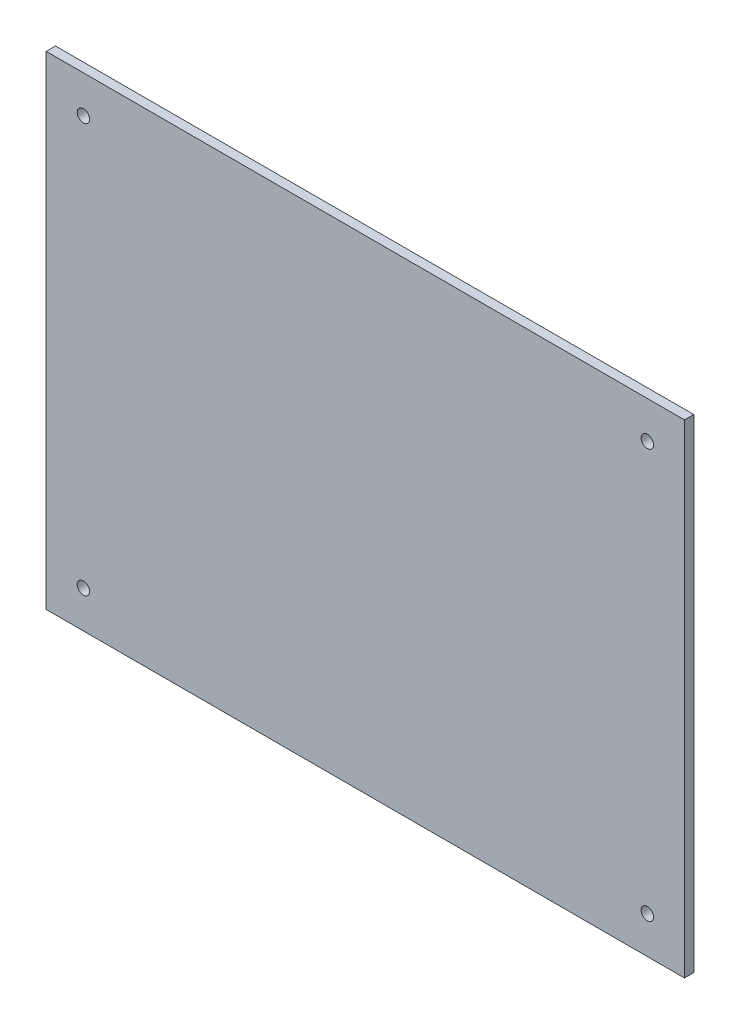
ISO-10303-21;
HEADER;
FILE_DESCRIPTION(('STEP AP214'),'2;1');
FILE_NAME('part.step','',(''),(''),'','','');
FILE_SCHEMA(('AUTOMOTIVE_DESIGN { 1 0 10303 214 1 1 1 1 }'));
ENDSEC;
DATA;
#1=APPLICATION_CONTEXT('core data for automotive mechanical design processes');
#2=APPLICATION_PROTOCOL_DEFINITION('international standard','automotive_design',2000,#1);
#3=PRODUCT_CONTEXT('',#1,'mechanical');
#4=PRODUCT('Part','Part','',(#3));
#5=PRODUCT_RELATED_PRODUCT_CATEGORY('part','',(#4));
#6=PRODUCT_DEFINITION_FORMATION('','',#4);
#7=PRODUCT_DEFINITION_CONTEXT('part definition',#1,'design');
#8=PRODUCT_DEFINITION('design','',#6,#7);
#9=PRODUCT_DEFINITION_SHAPE('','',#8);
#10=(LENGTH_UNIT() NAMED_UNIT(*) SI_UNIT(.MILLI.,.METRE.));
#11=(NAMED_UNIT(*) PLANE_ANGLE_UNIT() SI_UNIT($,.RADIAN.));
#12=(NAMED_UNIT(*) SI_UNIT($,.STERADIAN.) SOLID_ANGLE_UNIT());
#13=UNCERTAINTY_MEASURE_WITH_UNIT(LENGTH_MEASURE(1.E-05),#10,'distance_accuracy_value','');
#14=(GEOMETRIC_REPRESENTATION_CONTEXT(3) GLOBAL_UNCERTAINTY_ASSIGNED_CONTEXT((#13)) GLOBAL_UNIT_ASSIGNED_CONTEXT((#10,
#11,#12)) REPRESENTATION_CONTEXT('',''));
#15=CARTESIAN_POINT('',(0.,0.,0.));
#16=DIRECTION('',(0.,0.,1.));
#17=DIRECTION('',(1.,0.,0.));
#18=AXIS2_PLACEMENT_3D('',#15,#16,#17);
#19=CARTESIAN_POINT('',(0.,0.,3.));
#20=DIRECTION('',(1.,0.,0.));
#21=DIRECTION('',(0.,0.,-1.));
#22=AXIS2_PLACEMENT_3D('',#19,#20,#21);
#23=PLANE('',#22);
#24=DIRECTION('',(0.,-1.,0.));
#25=VECTOR('',#24,1.);
#26=CARTESIAN_POINT('',(0.,0.,0.));
#27=LINE('',#26,#25);
#28=CARTESIAN_POINT('',(0.,156.,0.));
#29=VERTEX_POINT('',#28);
#30=CARTESIAN_POINT('',(0.,0.,0.));
#31=VERTEX_POINT('',#30);
#32=EDGE_CURVE('E96',#29,#31,#27,.T.);
#33=ORIENTED_EDGE('',*,*,#32,.T.);
#34=DIRECTION('',(0.,0.,-1.));
#35=VECTOR('',#34,1.);
#36=CARTESIAN_POINT('',(0.,0.,3.));
#37=LINE('',#36,#35);
#38=CARTESIAN_POINT('',(0.,0.,3.));
#39=VERTEX_POINT('',#38);
#40=EDGE_CURVE('E11',#39,#31,#37,.T.);
#41=ORIENTED_EDGE('',*,*,#40,.F.);
#42=DIRECTION('',(0.,-1.,0.));
#43=VECTOR('',#42,1.);
#44=CARTESIAN_POINT('',(0.,0.,3.));
#45=LINE('',#44,#43);
#46=CARTESIAN_POINT('',(0.,156.,3.));
#47=VERTEX_POINT('',#46);
#48=EDGE_CURVE('E84',#47,#39,#45,.T.);
#49=ORIENTED_EDGE('',*,*,#48,.F.);
#50=DIRECTION('',(0.,0.,-1.));
#51=VECTOR('',#50,1.);
#52=CARTESIAN_POINT('',(0.,156.,3.));
#53=LINE('',#52,#51);
#54=EDGE_CURVE('E92',#47,#29,#53,.T.);
#55=ORIENTED_EDGE('',*,*,#54,.T.);
#56=EDGE_LOOP('',(#33,#41,#49,#55));
#57=FACE_BOUND('',#56,.T.);
#58=ADVANCED_FACE('F33',(#57),#23,.F.);
#59=CARTESIAN_POINT('',(0.,0.,3.));
#60=DIRECTION('',(0.,1.,0.));
#61=DIRECTION('',(0.,0.,1.));
#62=AXIS2_PLACEMENT_3D('',#59,#60,#61);
#63=PLANE('',#62);
#64=DIRECTION('',(1.,0.,0.));
#65=VECTOR('',#64,1.);
#66=CARTESIAN_POINT('',(0.,0.,0.));
#67=LINE('',#66,#65);
#68=CARTESIAN_POINT('',(206.,0.,0.));
#69=VERTEX_POINT('',#68);
#70=EDGE_CURVE('E88',#31,#69,#67,.T.);
#71=ORIENTED_EDGE('',*,*,#70,.T.);
#72=DIRECTION('',(0.,0.,-1.));
#73=VECTOR('',#72,1.);
#74=CARTESIAN_POINT('',(206.,0.,3.));
#75=LINE('',#74,#73);
#76=CARTESIAN_POINT('',(206.,0.,3.));
#77=VERTEX_POINT('',#76);
#78=EDGE_CURVE('E41',#77,#69,#75,.T.);
#79=ORIENTED_EDGE('',*,*,#78,.F.);
#80=DIRECTION('',(1.,0.,0.));
#81=VECTOR('',#80,1.);
#82=CARTESIAN_POINT('',(0.,0.,3.));
#83=LINE('',#82,#81);
#84=EDGE_CURVE('E79',#39,#77,#83,.T.);
#85=ORIENTED_EDGE('',*,*,#84,.F.);
#86=ORIENTED_EDGE('',*,*,#40,.T.);
#87=EDGE_LOOP('',(#71,#79,#85,#86));
#88=FACE_BOUND('',#87,.T.);
#89=ADVANCED_FACE('F87',(#88),#63,.F.);
#90=CARTESIAN_POINT('',(206.,0.,3.));
#91=DIRECTION('',(-1.,0.,0.));
#92=DIRECTION('',(0.,0.,1.));
#93=AXIS2_PLACEMENT_3D('',#90,#91,#92);
#94=PLANE('',#93);
#95=DIRECTION('',(0.,1.,0.));
#96=VECTOR('',#95,1.);
#97=CARTESIAN_POINT('',(206.,0.,0.));
#98=LINE('',#97,#96);
#99=CARTESIAN_POINT('',(206.,156.,0.));
#100=VERTEX_POINT('',#99);
#101=EDGE_CURVE('E66',#69,#100,#98,.T.);
#102=ORIENTED_EDGE('',*,*,#101,.T.);
#103=DIRECTION('',(0.,0.,-1.));
#104=VECTOR('',#103,1.);
#105=CARTESIAN_POINT('',(206.,156.,3.));
#106=LINE('',#105,#104);
#107=CARTESIAN_POINT('',(206.,156.,3.));
#108=VERTEX_POINT('',#107);
#109=EDGE_CURVE('E89',#108,#100,#106,.T.);
#110=ORIENTED_EDGE('',*,*,#109,.F.);
#111=DIRECTION('',(0.,1.,0.));
#112=VECTOR('',#111,1.);
#113=CARTESIAN_POINT('',(206.,0.,3.));
#114=LINE('',#113,#112);
#115=EDGE_CURVE('E82',#77,#108,#114,.T.);
#116=ORIENTED_EDGE('',*,*,#115,.F.);
#117=ORIENTED_EDGE('',*,*,#78,.T.);
#118=EDGE_LOOP('',(#102,#110,#116,#117));
#119=FACE_BOUND('',#118,.T.);
#120=ADVANCED_FACE('F90',(#119),#94,.F.);
#121=CARTESIAN_POINT('',(0.,156.,3.));
#122=DIRECTION('',(0.,-1.,0.));
#123=DIRECTION('',(0.,0.,-1.));
#124=AXIS2_PLACEMENT_3D('',#121,#122,#123);
#125=PLANE('',#124);
#126=DIRECTION('',(-1.,0.,0.));
#127=VECTOR('',#126,1.);
#128=CARTESIAN_POINT('',(0.,156.,0.));
#129=LINE('',#128,#127);
#130=EDGE_CURVE('E72',#100,#29,#129,.T.);
#131=ORIENTED_EDGE('',*,*,#130,.T.);
#132=ORIENTED_EDGE('',*,*,#54,.F.);
#133=DIRECTION('',(-1.,0.,0.));
#134=VECTOR('',#133,1.);
#135=CARTESIAN_POINT('',(0.,156.,3.));
#136=LINE('',#135,#134);
#137=EDGE_CURVE('E49',#108,#47,#136,.T.);
#138=ORIENTED_EDGE('',*,*,#137,.F.);
#139=ORIENTED_EDGE('',*,*,#109,.T.);
#140=EDGE_LOOP('',(#131,#132,#138,#139));
#141=FACE_BOUND('',#140,.T.);
#142=ADVANCED_FACE('F104',(#141),#125,.F.);
#143=CARTESIAN_POINT('',(0.,0.,3.));
#144=DIRECTION('',(0.,0.,-1.));
#145=DIRECTION('',(-1.,0.,0.));
#146=AXIS2_PLACEMENT_3D('',#143,#144,#145);
#147=PLANE('',#146);
#148=CARTESIAN_POINT('',(194.,144.,3.));
#149=DIRECTION('',(0.,0.,1.));
#150=DIRECTION('',(-1.,0.,0.));
#151=AXIS2_PLACEMENT_3D('',#148,#149,#150);
#152=CIRCLE('',#151,2.);
#153=CARTESIAN_POINT('',(192.,144.,3.));
#154=VERTEX_POINT('',#153);
#155=EDGE_CURVE('E128',#154,#154,#152,.T.);
#156=ORIENTED_EDGE('',*,*,#155,.F.);
#157=EDGE_LOOP('',(#156));
#158=FACE_BOUND('',#157,.T.);
#159=CARTESIAN_POINT('',(194.,12.,3.));
#160=DIRECTION('',(0.,0.,1.));
#161=DIRECTION('',(1.,0.,0.));
#162=AXIS2_PLACEMENT_3D('',#159,#160,#161);
#163=CIRCLE('',#162,2.);
#164=CARTESIAN_POINT('',(196.,12.,3.));
#165=VERTEX_POINT('',#164);
#166=EDGE_CURVE('E122',#165,#165,#163,.T.);
#167=ORIENTED_EDGE('',*,*,#166,.F.);
#168=EDGE_LOOP('',(#167));
#169=FACE_BOUND('',#168,.T.);
#170=CARTESIAN_POINT('',(12.,12.,3.));
#171=DIRECTION('',(0.,0.,1.));
#172=DIRECTION('',(-1.,0.,0.));
#173=AXIS2_PLACEMENT_3D('',#170,#171,#172);
#174=CIRCLE('',#173,2.);
#175=CARTESIAN_POINT('',(10.,12.,3.));
#176=VERTEX_POINT('',#175);
#177=EDGE_CURVE('E116',#176,#176,#174,.T.);
#178=ORIENTED_EDGE('',*,*,#177,.F.);
#179=EDGE_LOOP('',(#178));
#180=FACE_BOUND('',#179,.T.);
#181=CARTESIAN_POINT('',(12.,144.,3.));
#182=DIRECTION('',(0.,0.,1.));
#183=DIRECTION('',(1.,0.,0.));
#184=AXIS2_PLACEMENT_3D('',#181,#182,#183);
#185=CIRCLE('',#184,2.);
#186=CARTESIAN_POINT('',(14.,144.,3.));
#187=VERTEX_POINT('',#186);
#188=EDGE_CURVE('E110',#187,#187,#185,.T.);
#189=ORIENTED_EDGE('',*,*,#188,.F.);
#190=EDGE_LOOP('',(#189));
#191=FACE_BOUND('',#190,.T.);
#192=ORIENTED_EDGE('',*,*,#48,.T.);
#193=ORIENTED_EDGE('',*,*,#84,.T.);
#194=ORIENTED_EDGE('',*,*,#115,.T.);
#195=ORIENTED_EDGE('',*,*,#137,.T.);
#196=EDGE_LOOP('',(#192,#193,#194,#195));
#197=FACE_BOUND('',#196,.T.);
#198=ADVANCED_FACE('F80',(#158,#169,#180,#191,#197),#147,.F.);
#199=CARTESIAN_POINT('',(0.,0.,0.));
#200=DIRECTION('',(0.,0.,-1.));
#201=DIRECTION('',(-1.,0.,0.));
#202=AXIS2_PLACEMENT_3D('',#199,#200,#201);
#203=PLANE('',#202);
#204=CARTESIAN_POINT('',(194.,144.,0.));
#205=DIRECTION('',(0.,0.,1.));
#206=DIRECTION('',(-1.,0.,0.));
#207=AXIS2_PLACEMENT_3D('',#204,#205,#206);
#208=CIRCLE('',#207,2.);
#209=CARTESIAN_POINT('',(192.,144.,0.));
#210=VERTEX_POINT('',#209);
#211=EDGE_CURVE('E113',#210,#210,#208,.T.);
#212=ORIENTED_EDGE('',*,*,#211,.T.);
#213=EDGE_LOOP('',(#212));
#214=FACE_BOUND('',#213,.T.);
#215=CARTESIAN_POINT('',(194.,12.,0.));
#216=DIRECTION('',(0.,0.,1.));
#217=DIRECTION('',(1.,0.,0.));
#218=AXIS2_PLACEMENT_3D('',#215,#216,#217);
#219=CIRCLE('',#218,2.);
#220=CARTESIAN_POINT('',(196.,12.,0.));
#221=VERTEX_POINT('',#220);
#222=EDGE_CURVE('E125',#221,#221,#219,.T.);
#223=ORIENTED_EDGE('',*,*,#222,.T.);
#224=EDGE_LOOP('',(#223));
#225=FACE_BOUND('',#224,.T.);
#226=CARTESIAN_POINT('',(12.,12.,0.));
#227=DIRECTION('',(0.,0.,1.));
#228=DIRECTION('',(-1.,0.,0.));
#229=AXIS2_PLACEMENT_3D('',#226,#227,#228);
#230=CIRCLE('',#229,2.);
#231=CARTESIAN_POINT('',(10.,12.,0.));
#232=VERTEX_POINT('',#231);
#233=EDGE_CURVE('E119',#232,#232,#230,.T.);
#234=ORIENTED_EDGE('',*,*,#233,.T.);
#235=EDGE_LOOP('',(#234));
#236=FACE_BOUND('',#235,.T.);
#237=CARTESIAN_POINT('',(12.,144.,0.));
#238=DIRECTION('',(0.,0.,1.));
#239=DIRECTION('',(1.,0.,0.));
#240=AXIS2_PLACEMENT_3D('',#237,#238,#239);
#241=CIRCLE('',#240,2.);
#242=CARTESIAN_POINT('',(14.,144.,0.));
#243=VERTEX_POINT('',#242);
#244=EDGE_CURVE('E99',#243,#243,#241,.T.);
#245=ORIENTED_EDGE('',*,*,#244,.T.);
#246=EDGE_LOOP('',(#245));
#247=FACE_BOUND('',#246,.T.);
#248=ORIENTED_EDGE('',*,*,#32,.F.);
#249=ORIENTED_EDGE('',*,*,#130,.F.);
#250=ORIENTED_EDGE('',*,*,#101,.F.);
#251=ORIENTED_EDGE('',*,*,#70,.F.);
#252=EDGE_LOOP('',(#248,#249,#250,#251));
#253=FACE_BOUND('',#252,.T.);
#254=ADVANCED_FACE('F107',(#214,#225,#236,#247,#253),#203,.T.);
#255=CARTESIAN_POINT('',(12.,144.,0.));
#256=DIRECTION('',(0.,0.,1.));
#257=DIRECTION('',(1.,0.,0.));
#258=AXIS2_PLACEMENT_3D('',#255,#256,#257);
#259=CYLINDRICAL_SURFACE('',#258,2.);
#260=ORIENTED_EDGE('',*,*,#244,.F.);
#261=EDGE_LOOP('',(#260));
#262=FACE_BOUND('',#261,.T.);
#263=ORIENTED_EDGE('',*,*,#188,.T.);
#264=EDGE_LOOP('',(#263));
#265=FACE_BOUND('',#264,.T.);
#266=ADVANCED_FACE('F152',(#262,#265),#259,.F.);
#267=CARTESIAN_POINT('',(12.,12.,0.));
#268=DIRECTION('',(0.,0.,1.));
#269=DIRECTION('',(1.,0.,0.));
#270=AXIS2_PLACEMENT_3D('',#267,#268,#269);
#271=CYLINDRICAL_SURFACE('',#270,2.);
#272=ORIENTED_EDGE('',*,*,#233,.F.);
#273=EDGE_LOOP('',(#272));
#274=FACE_BOUND('',#273,.T.);
#275=ORIENTED_EDGE('',*,*,#177,.T.);
#276=EDGE_LOOP('',(#275));
#277=FACE_BOUND('',#276,.T.);
#278=ADVANCED_FACE('F154',(#274,#277),#271,.F.);
#279=CARTESIAN_POINT('',(194.,12.,0.));
#280=DIRECTION('',(0.,0.,1.));
#281=DIRECTION('',(1.,0.,0.));
#282=AXIS2_PLACEMENT_3D('',#279,#280,#281);
#283=CYLINDRICAL_SURFACE('',#282,2.);
#284=ORIENTED_EDGE('',*,*,#222,.F.);
#285=EDGE_LOOP('',(#284));
#286=FACE_BOUND('',#285,.T.);
#287=ORIENTED_EDGE('',*,*,#166,.T.);
#288=EDGE_LOOP('',(#287));
#289=FACE_BOUND('',#288,.T.);
#290=ADVANCED_FACE('F139',(#286,#289),#283,.F.);
#291=CARTESIAN_POINT('',(194.,144.,0.));
#292=DIRECTION('',(0.,0.,1.));
#293=DIRECTION('',(1.,0.,0.));
#294=AXIS2_PLACEMENT_3D('',#291,#292,#293);
#295=CYLINDRICAL_SURFACE('',#294,2.);
#296=ORIENTED_EDGE('',*,*,#211,.F.);
#297=EDGE_LOOP('',(#296));
#298=FACE_BOUND('',#297,.T.);
#299=ORIENTED_EDGE('',*,*,#155,.T.);
#300=EDGE_LOOP('',(#299));
#301=FACE_BOUND('',#300,.T.);
#302=ADVANCED_FACE('F136',(#298,#301),#295,.F.);
#303=CLOSED_SHELL('',(#58,#89,#120,#142,#198,#254,#266,#278,#290,#302));
#304=MANIFOLD_SOLID_BREP('B2',#303);
#305=ADVANCED_BREP_SHAPE_REPRESENTATION('',(#18,#304),#14);
#306=SHAPE_DEFINITION_REPRESENTATION(#9,#305);
ENDSEC;
END-ISO-10303-21;
